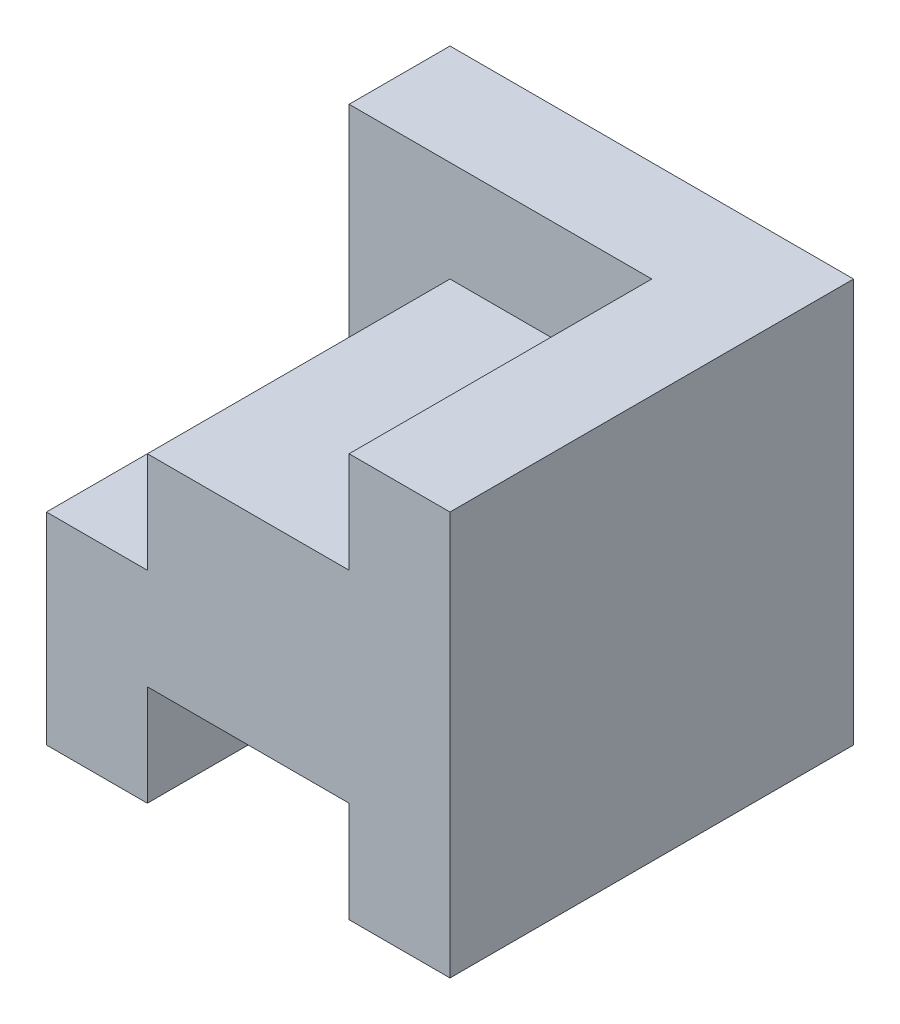
ISO-10303-21;
HEADER;
FILE_DESCRIPTION(('STEP AP214'),'2;1');
FILE_NAME('part.step','',(''),(''),'','','');
FILE_SCHEMA(('AUTOMOTIVE_DESIGN { 1 0 10303 214 1 1 1 1 }'));
ENDSEC;
DATA;
#1=APPLICATION_CONTEXT('core data for automotive mechanical design processes');
#2=APPLICATION_PROTOCOL_DEFINITION('international standard','automotive_design',2000,#1);
#3=PRODUCT_CONTEXT('',#1,'mechanical');
#4=PRODUCT('Part','Part','',(#3));
#5=PRODUCT_RELATED_PRODUCT_CATEGORY('part','',(#4));
#6=PRODUCT_DEFINITION_FORMATION('','',#4);
#7=PRODUCT_DEFINITION_CONTEXT('part definition',#1,'design');
#8=PRODUCT_DEFINITION('design','',#6,#7);
#9=PRODUCT_DEFINITION_SHAPE('','',#8);
#10=(LENGTH_UNIT() NAMED_UNIT(*) SI_UNIT(.MILLI.,.METRE.));
#11=(NAMED_UNIT(*) PLANE_ANGLE_UNIT() SI_UNIT($,.RADIAN.));
#12=(NAMED_UNIT(*) SI_UNIT($,.STERADIAN.) SOLID_ANGLE_UNIT());
#13=UNCERTAINTY_MEASURE_WITH_UNIT(LENGTH_MEASURE(1.E-05),#10,'distance_accuracy_value','');
#14=(GEOMETRIC_REPRESENTATION_CONTEXT(3) GLOBAL_UNCERTAINTY_ASSIGNED_CONTEXT((#13)) GLOBAL_UNIT_ASSIGNED_CONTEXT((#10,
#11,#12)) REPRESENTATION_CONTEXT('',''));
#15=CARTESIAN_POINT('',(0.,0.,0.));
#16=DIRECTION('',(0.,0.,1.));
#17=DIRECTION('',(1.,0.,0.));
#18=AXIS2_PLACEMENT_3D('',#15,#16,#17);
#19=CARTESIAN_POINT('',(3.,3.,4.));
#20=DIRECTION('',(1.,0.,0.));
#21=DIRECTION('',(0.,0.,-1.));
#22=AXIS2_PLACEMENT_3D('',#19,#20,#21);
#23=PLANE('',#22);
#24=DIRECTION('',(0.,-1.,0.));
#25=VECTOR('',#24,1.);
#26=CARTESIAN_POINT('',(3.,2.,1.));
#27=LINE('',#26,#25);
#28=CARTESIAN_POINT('',(3.,4.,1.));
#29=VERTEX_POINT('',#28);
#30=CARTESIAN_POINT('',(3.,3.,1.));
#31=VERTEX_POINT('',#30);
#32=EDGE_CURVE('E52',#29,#31,#27,.T.);
#33=ORIENTED_EDGE('',*,*,#32,.T.);
#34=DIRECTION('',(0.,0.,-1.));
#35=VECTOR('',#34,1.);
#36=CARTESIAN_POINT('',(3.,3.,4.));
#37=LINE('',#36,#35);
#38=CARTESIAN_POINT('',(3.,3.,4.));
#39=VERTEX_POINT('',#38);
#40=EDGE_CURVE('E212',#39,#31,#37,.T.);
#41=ORIENTED_EDGE('',*,*,#40,.F.);
#42=DIRECTION('',(0.,-1.,0.));
#43=VECTOR('',#42,1.);
#44=CARTESIAN_POINT('',(3.,3.,4.));
#45=LINE('',#44,#43);
#46=CARTESIAN_POINT('',(3.,4.,4.));
#47=VERTEX_POINT('',#46);
#48=EDGE_CURVE('E178',#47,#39,#45,.T.);
#49=ORIENTED_EDGE('',*,*,#48,.F.);
#50=DIRECTION('',(0.,0.,-1.));
#51=VECTOR('',#50,1.);
#52=CARTESIAN_POINT('',(3.,4.,4.));
#53=LINE('',#52,#51);
#54=EDGE_CURVE('E48',#47,#29,#53,.T.);
#55=ORIENTED_EDGE('',*,*,#54,.T.);
#56=EDGE_LOOP('',(#33,#41,#49,#55));
#57=FACE_BOUND('',#56,.T.);
#58=ADVANCED_FACE('F33',(#57),#23,.F.);
#59=CARTESIAN_POINT('',(1.,3.,4.));
#60=DIRECTION('',(0.,-1.,0.));
#61=DIRECTION('',(0.,0.,-1.));
#62=AXIS2_PLACEMENT_3D('',#59,#60,#61);
#63=PLANE('',#62);
#64=DIRECTION('',(1.,0.,0.));
#65=VECTOR('',#64,1.);
#66=CARTESIAN_POINT('',(1.,3.,1.));
#67=LINE('',#66,#65);
#68=CARTESIAN_POINT('',(1.,3.,1.));
#69=VERTEX_POINT('',#68);
#70=EDGE_CURVE('E159',#69,#31,#67,.T.);
#71=ORIENTED_EDGE('',*,*,#70,.F.);
#72=DIRECTION('',(0.,0.,-1.));
#73=VECTOR('',#72,1.);
#74=CARTESIAN_POINT('',(1.,3.,4.));
#75=LINE('',#74,#73);
#76=CARTESIAN_POINT('',(1.,3.,4.));
#77=VERTEX_POINT('',#76);
#78=EDGE_CURVE('E209',#77,#69,#75,.T.);
#79=ORIENTED_EDGE('',*,*,#78,.F.);
#80=DIRECTION('',(-1.,0.,0.));
#81=VECTOR('',#80,1.);
#82=CARTESIAN_POINT('',(1.,3.,4.));
#83=LINE('',#82,#81);
#84=EDGE_CURVE('E180',#39,#77,#83,.T.);
#85=ORIENTED_EDGE('',*,*,#84,.F.);
#86=ORIENTED_EDGE('',*,*,#40,.T.);
#87=EDGE_LOOP('',(#71,#79,#85,#86));
#88=FACE_BOUND('',#87,.T.);
#89=ADVANCED_FACE('F266',(#88),#63,.F.);
#90=CARTESIAN_POINT('',(1.,2.,4.));
#91=DIRECTION('',(1.,0.,0.));
#92=DIRECTION('',(0.,0.,-1.));
#93=AXIS2_PLACEMENT_3D('',#90,#91,#92);
#94=PLANE('',#93);
#95=DIRECTION('',(0.,1.,0.));
#96=VECTOR('',#95,1.);
#97=CARTESIAN_POINT('',(1.,2.,1.));
#98=LINE('',#97,#96);
#99=CARTESIAN_POINT('',(1.,2.,1.));
#100=VERTEX_POINT('',#99);
#101=EDGE_CURVE('E138',#100,#69,#98,.T.);
#102=ORIENTED_EDGE('',*,*,#101,.F.);
#103=DIRECTION('',(0.,0.,-1.));
#104=VECTOR('',#103,1.);
#105=CARTESIAN_POINT('',(1.,2.,4.));
#106=LINE('',#105,#104);
#107=CARTESIAN_POINT('',(1.,2.,4.));
#108=VERTEX_POINT('',#107);
#109=EDGE_CURVE('E206',#108,#100,#106,.T.);
#110=ORIENTED_EDGE('',*,*,#109,.F.);
#111=DIRECTION('',(0.,-1.,0.));
#112=VECTOR('',#111,1.);
#113=CARTESIAN_POINT('',(1.,2.,4.));
#114=LINE('',#113,#112);
#115=EDGE_CURVE('E182',#77,#108,#114,.T.);
#116=ORIENTED_EDGE('',*,*,#115,.F.);
#117=ORIENTED_EDGE('',*,*,#78,.T.);
#118=EDGE_LOOP('',(#102,#110,#116,#117));
#119=FACE_BOUND('',#118,.T.);
#120=ADVANCED_FACE('F262',(#119),#94,.F.);
#121=CARTESIAN_POINT('',(0.,2.,4.));
#122=DIRECTION('',(0.,-1.,0.));
#123=DIRECTION('',(1.,0.,0.));
#124=AXIS2_PLACEMENT_3D('',#121,#122,#123);
#125=PLANE('',#124);
#126=DIRECTION('',(-1.,0.,0.));
#127=VECTOR('',#126,1.);
#128=CARTESIAN_POINT('',(0.,2.,1.));
#129=LINE('',#128,#127);
#130=CARTESIAN_POINT('',(0.,2.,1.));
#131=VERTEX_POINT('',#130);
#132=EDGE_CURVE('E139',#100,#131,#129,.T.);
#133=ORIENTED_EDGE('',*,*,#132,.T.);
#134=DIRECTION('',(0.,0.,-1.));
#135=VECTOR('',#134,1.);
#136=CARTESIAN_POINT('',(0.,2.,4.));
#137=LINE('',#136,#135);
#138=CARTESIAN_POINT('',(0.,2.,4.));
#139=VERTEX_POINT('',#138);
#140=EDGE_CURVE('E153',#139,#131,#137,.T.);
#141=ORIENTED_EDGE('',*,*,#140,.F.);
#142=DIRECTION('',(-1.,0.,0.));
#143=VECTOR('',#142,1.);
#144=CARTESIAN_POINT('',(0.,2.,4.));
#145=LINE('',#144,#143);
#146=EDGE_CURVE('E184',#108,#139,#145,.T.);
#147=ORIENTED_EDGE('',*,*,#146,.F.);
#148=ORIENTED_EDGE('',*,*,#109,.T.);
#149=EDGE_LOOP('',(#133,#141,#147,#148));
#150=FACE_BOUND('',#149,.T.);
#151=ADVANCED_FACE('F260',(#150),#125,.F.);
#152=CARTESIAN_POINT('',(1.,0.,4.));
#153=DIRECTION('',(0.,1.,0.));
#154=DIRECTION('',(-1.,0.,0.));
#155=AXIS2_PLACEMENT_3D('',#152,#153,#154);
#156=PLANE('',#155);
#157=DIRECTION('',(1.,0.,0.));
#158=VECTOR('',#157,1.);
#159=CARTESIAN_POINT('',(1.,0.,0.));
#160=LINE('',#159,#158);
#161=CARTESIAN_POINT('',(0.,0.,0.));
#162=VERTEX_POINT('',#161);
#163=CARTESIAN_POINT('',(1.,0.,0.));
#164=VERTEX_POINT('',#163);
#165=EDGE_CURVE('E161',#162,#164,#160,.T.);
#166=ORIENTED_EDGE('',*,*,#165,.T.);
#167=DIRECTION('',(0.,0.,-1.));
#168=VECTOR('',#167,1.);
#169=CARTESIAN_POINT('',(1.,0.,4.));
#170=LINE('',#169,#168);
#171=CARTESIAN_POINT('',(1.,0.,4.));
#172=VERTEX_POINT('',#171);
#173=EDGE_CURVE('E11',#172,#164,#170,.T.);
#174=ORIENTED_EDGE('',*,*,#173,.F.);
#175=DIRECTION('',(1.,0.,0.));
#176=VECTOR('',#175,1.);
#177=CARTESIAN_POINT('',(1.,0.,4.));
#178=LINE('',#177,#176);
#179=CARTESIAN_POINT('',(0.,0.,4.));
#180=VERTEX_POINT('',#179);
#181=EDGE_CURVE('E162',#180,#172,#178,.T.);
#182=ORIENTED_EDGE('',*,*,#181,.F.);
#183=DIRECTION('',(0.,0.,-1.));
#184=VECTOR('',#183,1.);
#185=CARTESIAN_POINT('',(0.,0.,4.));
#186=LINE('',#185,#184);
#187=EDGE_CURVE('E188',#180,#162,#186,.T.);
#188=ORIENTED_EDGE('',*,*,#187,.T.);
#189=EDGE_LOOP('',(#166,#174,#182,#188));
#190=FACE_BOUND('',#189,.T.);
#191=ADVANCED_FACE('F35',(#190),#156,.F.);
#192=CARTESIAN_POINT('',(1.,1.,4.));
#193=DIRECTION('',(-1.,0.,0.));
#194=DIRECTION('',(0.,0.,1.));
#195=AXIS2_PLACEMENT_3D('',#192,#193,#194);
#196=PLANE('',#195);
#197=DIRECTION('',(0.,1.,0.));
#198=VECTOR('',#197,1.);
#199=CARTESIAN_POINT('',(1.,1.,0.));
#200=LINE('',#199,#198);
#201=CARTESIAN_POINT('',(1.,1.,0.));
#202=VERTEX_POINT('',#201);
#203=EDGE_CURVE('E191',#164,#202,#200,.T.);
#204=ORIENTED_EDGE('',*,*,#203,.T.);
#205=DIRECTION('',(0.,0.,-1.));
#206=VECTOR('',#205,1.);
#207=CARTESIAN_POINT('',(1.,1.,4.));
#208=LINE('',#207,#206);
#209=CARTESIAN_POINT('',(1.,1.,4.));
#210=VERTEX_POINT('',#209);
#211=EDGE_CURVE('E41',#210,#202,#208,.T.);
#212=ORIENTED_EDGE('',*,*,#211,.F.);
#213=DIRECTION('',(0.,1.,0.));
#214=VECTOR('',#213,1.);
#215=CARTESIAN_POINT('',(1.,1.,4.));
#216=LINE('',#215,#214);
#217=EDGE_CURVE('E165',#172,#210,#216,.T.);
#218=ORIENTED_EDGE('',*,*,#217,.F.);
#219=ORIENTED_EDGE('',*,*,#173,.T.);
#220=EDGE_LOOP('',(#204,#212,#218,#219));
#221=FACE_BOUND('',#220,.T.);
#222=ADVANCED_FACE('F253',(#221),#196,.F.);
#223=CARTESIAN_POINT('',(3.,1.,4.));
#224=DIRECTION('',(0.,1.,0.));
#225=DIRECTION('',(-1.,0.,0.));
#226=AXIS2_PLACEMENT_3D('',#223,#224,#225);
#227=PLANE('',#226);
#228=DIRECTION('',(1.,0.,0.));
#229=VECTOR('',#228,1.);
#230=CARTESIAN_POINT('',(3.,1.,0.));
#231=LINE('',#230,#229);
#232=CARTESIAN_POINT('',(3.,1.,0.));
#233=VERTEX_POINT('',#232);
#234=EDGE_CURVE('E193',#202,#233,#231,.T.);
#235=ORIENTED_EDGE('',*,*,#234,.T.);
#236=DIRECTION('',(0.,0.,-1.));
#237=VECTOR('',#236,1.);
#238=CARTESIAN_POINT('',(3.,1.,4.));
#239=LINE('',#238,#237);
#240=CARTESIAN_POINT('',(3.,1.,4.));
#241=VERTEX_POINT('',#240);
#242=EDGE_CURVE('E223',#241,#233,#239,.T.);
#243=ORIENTED_EDGE('',*,*,#242,.F.);
#244=DIRECTION('',(1.,0.,0.));
#245=VECTOR('',#244,1.);
#246=CARTESIAN_POINT('',(3.,1.,4.));
#247=LINE('',#246,#245);
#248=EDGE_CURVE('E168',#210,#241,#247,.T.);
#249=ORIENTED_EDGE('',*,*,#248,.F.);
#250=ORIENTED_EDGE('',*,*,#211,.T.);
#251=EDGE_LOOP('',(#235,#243,#249,#250));
#252=FACE_BOUND('',#251,.T.);
#253=ADVANCED_FACE('F230',(#252),#227,.F.);
#254=CARTESIAN_POINT('',(3.,0.,4.));
#255=DIRECTION('',(1.,0.,0.));
#256=DIRECTION('',(0.,0.,-1.));
#257=AXIS2_PLACEMENT_3D('',#254,#255,#256);
#258=PLANE('',#257);
#259=DIRECTION('',(0.,-1.,0.));
#260=VECTOR('',#259,1.);
#261=CARTESIAN_POINT('',(3.,0.,0.));
#262=LINE('',#261,#260);
#263=CARTESIAN_POINT('',(3.,0.,0.));
#264=VERTEX_POINT('',#263);
#265=EDGE_CURVE('E195',#233,#264,#262,.T.);
#266=ORIENTED_EDGE('',*,*,#265,.T.);
#267=DIRECTION('',(0.,0.,-1.));
#268=VECTOR('',#267,1.);
#269=CARTESIAN_POINT('',(3.,0.,4.));
#270=LINE('',#269,#268);
#271=CARTESIAN_POINT('',(3.,0.,4.));
#272=VERTEX_POINT('',#271);
#273=EDGE_CURVE('E220',#272,#264,#270,.T.);
#274=ORIENTED_EDGE('',*,*,#273,.F.);
#275=DIRECTION('',(0.,-1.,0.));
#276=VECTOR('',#275,1.);
#277=CARTESIAN_POINT('',(3.,0.,4.));
#278=LINE('',#277,#276);
#279=EDGE_CURVE('E170',#241,#272,#278,.T.);
#280=ORIENTED_EDGE('',*,*,#279,.F.);
#281=ORIENTED_EDGE('',*,*,#242,.T.);
#282=EDGE_LOOP('',(#266,#274,#280,#281));
#283=FACE_BOUND('',#282,.T.);
#284=ADVANCED_FACE('F241',(#283),#258,.F.);
#285=CARTESIAN_POINT('',(4.,0.,4.));
#286=DIRECTION('',(0.,1.,0.));
#287=DIRECTION('',(-1.,0.,0.));
#288=AXIS2_PLACEMENT_3D('',#285,#286,#287);
#289=PLANE('',#288);
#290=DIRECTION('',(1.,0.,0.));
#291=VECTOR('',#290,1.);
#292=CARTESIAN_POINT('',(4.,0.,0.));
#293=LINE('',#292,#291);
#294=CARTESIAN_POINT('',(4.,0.,0.));
#295=VERTEX_POINT('',#294);
#296=EDGE_CURVE('E197',#264,#295,#293,.T.);
#297=ORIENTED_EDGE('',*,*,#296,.T.);
#298=DIRECTION('',(0.,0.,-1.));
#299=VECTOR('',#298,1.);
#300=CARTESIAN_POINT('',(4.,0.,4.));
#301=LINE('',#300,#299);
#302=CARTESIAN_POINT('',(4.,0.,4.));
#303=VERTEX_POINT('',#302);
#304=EDGE_CURVE('E217',#303,#295,#301,.T.);
#305=ORIENTED_EDGE('',*,*,#304,.F.);
#306=DIRECTION('',(1.,0.,0.));
#307=VECTOR('',#306,1.);
#308=CARTESIAN_POINT('',(4.,0.,4.));
#309=LINE('',#308,#307);
#310=EDGE_CURVE('E172',#272,#303,#309,.T.);
#311=ORIENTED_EDGE('',*,*,#310,.F.);
#312=ORIENTED_EDGE('',*,*,#273,.T.);
#313=EDGE_LOOP('',(#297,#305,#311,#312));
#314=FACE_BOUND('',#313,.T.);
#315=ADVANCED_FACE('F245',(#314),#289,.F.);
#316=CARTESIAN_POINT('',(4.,4.,4.));
#317=DIRECTION('',(-1.,0.,0.));
#318=DIRECTION('',(0.,-1.,0.));
#319=AXIS2_PLACEMENT_3D('',#316,#317,#318);
#320=PLANE('',#319);
#321=DIRECTION('',(0.,1.,0.));
#322=VECTOR('',#321,1.);
#323=CARTESIAN_POINT('',(4.,4.,0.));
#324=LINE('',#323,#322);
#325=CARTESIAN_POINT('',(4.,4.,0.));
#326=VERTEX_POINT('',#325);
#327=EDGE_CURVE('E199',#295,#326,#324,.T.);
#328=ORIENTED_EDGE('',*,*,#327,.T.);
#329=DIRECTION('',(0.,0.,-1.));
#330=VECTOR('',#329,1.);
#331=CARTESIAN_POINT('',(4.,4.,4.));
#332=LINE('',#331,#330);
#333=CARTESIAN_POINT('',(4.,4.,4.));
#334=VERTEX_POINT('',#333);
#335=EDGE_CURVE('E215',#334,#326,#332,.T.);
#336=ORIENTED_EDGE('',*,*,#335,.F.);
#337=DIRECTION('',(0.,1.,0.));
#338=VECTOR('',#337,1.);
#339=CARTESIAN_POINT('',(4.,4.,4.));
#340=LINE('',#339,#338);
#341=EDGE_CURVE('E174',#303,#334,#340,.T.);
#342=ORIENTED_EDGE('',*,*,#341,.F.);
#343=ORIENTED_EDGE('',*,*,#304,.T.);
#344=EDGE_LOOP('',(#328,#336,#342,#343));
#345=FACE_BOUND('',#344,.T.);
#346=ADVANCED_FACE('F269',(#345),#320,.F.);
#347=CARTESIAN_POINT('',(3.,4.,4.));
#348=DIRECTION('',(0.,-1.,0.));
#349=DIRECTION('',(0.,0.,-1.));
#350=AXIS2_PLACEMENT_3D('',#347,#348,#349);
#351=PLANE('',#350);
#352=DIRECTION('',(-1.,0.,0.));
#353=VECTOR('',#352,1.);
#354=CARTESIAN_POINT('',(3.,4.,0.));
#355=LINE('',#354,#353);
#356=CARTESIAN_POINT('',(0.,4.,0.));
#357=VERTEX_POINT('',#356);
#358=EDGE_CURVE('E135',#326,#357,#355,.T.);
#359=ORIENTED_EDGE('',*,*,#358,.T.);
#360=DIRECTION('',(0.,0.,-1.));
#361=VECTOR('',#360,1.);
#362=CARTESIAN_POINT('',(0.,4.,1.));
#363=LINE('',#362,#361);
#364=CARTESIAN_POINT('',(0.,4.,1.));
#365=VERTEX_POINT('',#364);
#366=EDGE_CURVE('E129',#365,#357,#363,.T.);
#367=ORIENTED_EDGE('',*,*,#366,.F.);
#368=DIRECTION('',(1.,0.,0.));
#369=VECTOR('',#368,1.);
#370=CARTESIAN_POINT('',(0.,4.,1.));
#371=LINE('',#370,#369);
#372=EDGE_CURVE('E132',#365,#29,#371,.T.);
#373=ORIENTED_EDGE('',*,*,#372,.T.);
#374=ORIENTED_EDGE('',*,*,#54,.F.);
#375=DIRECTION('',(-1.,0.,0.));
#376=VECTOR('',#375,1.);
#377=CARTESIAN_POINT('',(3.,4.,4.));
#378=LINE('',#377,#376);
#379=EDGE_CURVE('E176',#334,#47,#378,.T.);
#380=ORIENTED_EDGE('',*,*,#379,.F.);
#381=ORIENTED_EDGE('',*,*,#335,.T.);
#382=EDGE_LOOP('',(#359,#367,#373,#374,#380,#381));
#383=FACE_BOUND('',#382,.T.);
#384=ADVANCED_FACE('F131',(#383),#351,.F.);
#385=CARTESIAN_POINT('',(0.,0.,4.));
#386=DIRECTION('',(1.,0.,0.));
#387=DIRECTION('',(0.,0.,-1.));
#388=AXIS2_PLACEMENT_3D('',#385,#386,#387);
#389=PLANE('',#388);
#390=DIRECTION('',(0.,-1.,0.));
#391=VECTOR('',#390,1.);
#392=CARTESIAN_POINT('',(0.,0.,0.));
#393=LINE('',#392,#391);
#394=EDGE_CURVE('E166',#357,#162,#393,.T.);
#395=ORIENTED_EDGE('',*,*,#394,.T.);
#396=ORIENTED_EDGE('',*,*,#187,.F.);
#397=DIRECTION('',(0.,-1.,0.));
#398=VECTOR('',#397,1.);
#399=CARTESIAN_POINT('',(0.,0.,4.));
#400=LINE('',#399,#398);
#401=EDGE_CURVE('E186',#139,#180,#400,.T.);
#402=ORIENTED_EDGE('',*,*,#401,.F.);
#403=ORIENTED_EDGE('',*,*,#140,.T.);
#404=DIRECTION('',(0.,1.,0.));
#405=VECTOR('',#404,1.);
#406=CARTESIAN_POINT('',(0.,2.,1.));
#407=LINE('',#406,#405);
#408=EDGE_CURVE('E146',#131,#365,#407,.T.);
#409=ORIENTED_EDGE('',*,*,#408,.T.);
#410=ORIENTED_EDGE('',*,*,#366,.T.);
#411=EDGE_LOOP('',(#395,#396,#402,#403,#409,#410));
#412=FACE_BOUND('',#411,.T.);
#413=ADVANCED_FACE('F150',(#412),#389,.F.);
#414=CARTESIAN_POINT('',(0.,0.,4.));
#415=DIRECTION('',(0.,0.,-1.));
#416=DIRECTION('',(-1.,0.,0.));
#417=AXIS2_PLACEMENT_3D('',#414,#415,#416);
#418=PLANE('',#417);
#419=ORIENTED_EDGE('',*,*,#181,.T.);
#420=ORIENTED_EDGE('',*,*,#217,.T.);
#421=ORIENTED_EDGE('',*,*,#248,.T.);
#422=ORIENTED_EDGE('',*,*,#279,.T.);
#423=ORIENTED_EDGE('',*,*,#310,.T.);
#424=ORIENTED_EDGE('',*,*,#341,.T.);
#425=ORIENTED_EDGE('',*,*,#379,.T.);
#426=ORIENTED_EDGE('',*,*,#48,.T.);
#427=ORIENTED_EDGE('',*,*,#84,.T.);
#428=ORIENTED_EDGE('',*,*,#115,.T.);
#429=ORIENTED_EDGE('',*,*,#146,.T.);
#430=ORIENTED_EDGE('',*,*,#401,.T.);
#431=EDGE_LOOP('',(#419,#420,#421,#422,#423,#424,#425,#426,#427,#428,#429,#430));
#432=FACE_BOUND('',#431,.T.);
#433=ADVANCED_FACE('F249',(#432),#418,.F.);
#434=CARTESIAN_POINT('',(0.,0.,0.));
#435=DIRECTION('',(0.,0.,-1.));
#436=DIRECTION('',(-1.,0.,0.));
#437=AXIS2_PLACEMENT_3D('',#434,#435,#436);
#438=PLANE('',#437);
#439=ORIENTED_EDGE('',*,*,#394,.F.);
#440=ORIENTED_EDGE('',*,*,#358,.F.);
#441=ORIENTED_EDGE('',*,*,#327,.F.);
#442=ORIENTED_EDGE('',*,*,#296,.F.);
#443=ORIENTED_EDGE('',*,*,#265,.F.);
#444=ORIENTED_EDGE('',*,*,#234,.F.);
#445=ORIENTED_EDGE('',*,*,#203,.F.);
#446=ORIENTED_EDGE('',*,*,#165,.F.);
#447=EDGE_LOOP('',(#439,#440,#441,#442,#443,#444,#445,#446));
#448=FACE_BOUND('',#447,.T.);
#449=ADVANCED_FACE('F235',(#448),#438,.T.);
#450=CARTESIAN_POINT('',(0.,0.,1.));
#451=DIRECTION('',(0.,0.,-1.));
#452=DIRECTION('',(-1.,0.,0.));
#453=AXIS2_PLACEMENT_3D('',#450,#451,#452);
#454=PLANE('',#453);
#455=ORIENTED_EDGE('',*,*,#101,.T.);
#456=ORIENTED_EDGE('',*,*,#70,.T.);
#457=ORIENTED_EDGE('',*,*,#32,.F.);
#458=ORIENTED_EDGE('',*,*,#372,.F.);
#459=ORIENTED_EDGE('',*,*,#408,.F.);
#460=ORIENTED_EDGE('',*,*,#132,.F.);
#461=EDGE_LOOP('',(#455,#456,#457,#458,#459,#460));
#462=FACE_BOUND('',#461,.T.);
#463=ADVANCED_FACE('F144',(#462),#454,.F.);
#464=CLOSED_SHELL('',(#58,#89,#120,#151,#191,#222,#253,#284,#315,#346,#384,#413,#433,#449,#463));
#465=MANIFOLD_SOLID_BREP('B2',#464);
#466=ADVANCED_BREP_SHAPE_REPRESENTATION('',(#18,#465),#14);
#467=SHAPE_DEFINITION_REPRESENTATION(#9,#466);
ENDSEC;
END-ISO-10303-21;
